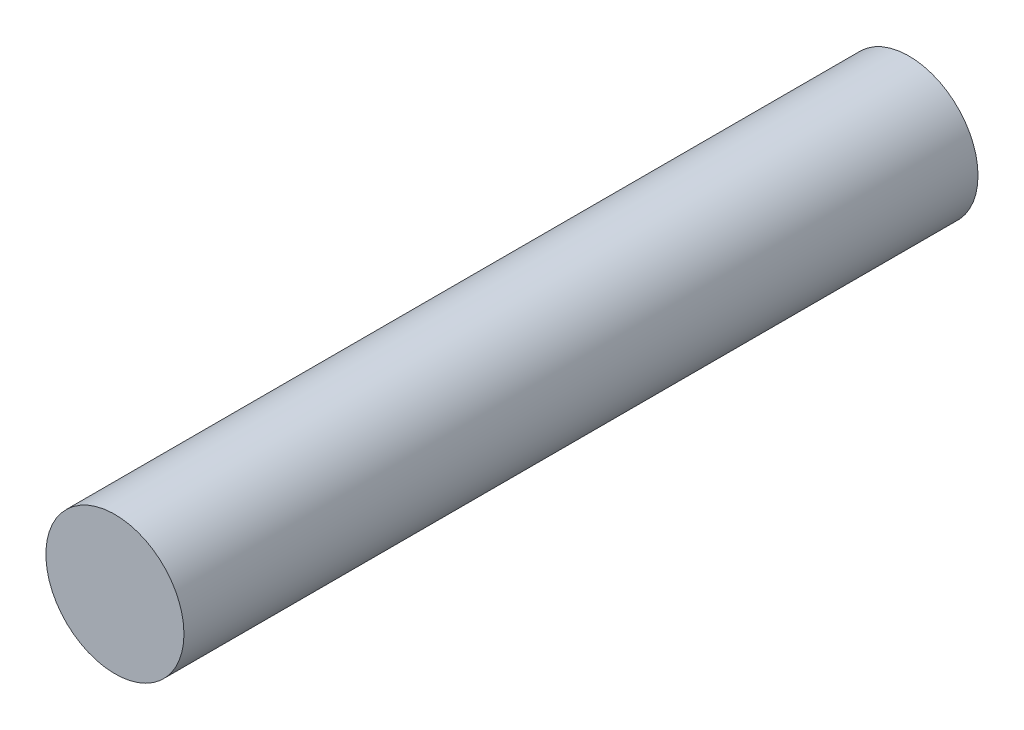
ISO-10303-21;
HEADER;
FILE_DESCRIPTION(('STEP AP214'),'2;1');
FILE_NAME('part.step','',(''),(''),'','','');
FILE_SCHEMA(('AUTOMOTIVE_DESIGN { 1 0 10303 214 1 1 1 1 }'));
ENDSEC;
DATA;
#1=APPLICATION_CONTEXT('core data for automotive mechanical design processes');
#2=APPLICATION_PROTOCOL_DEFINITION('international standard','automotive_design',2000,#1);
#3=PRODUCT_CONTEXT('',#1,'mechanical');
#4=PRODUCT('Part','Part','',(#3));
#5=PRODUCT_RELATED_PRODUCT_CATEGORY('part','',(#4));
#6=PRODUCT_DEFINITION_FORMATION('','',#4);
#7=PRODUCT_DEFINITION_CONTEXT('part definition',#1,'design');
#8=PRODUCT_DEFINITION('design','',#6,#7);
#9=PRODUCT_DEFINITION_SHAPE('','',#8);
#10=(LENGTH_UNIT() NAMED_UNIT(*) SI_UNIT(.MILLI.,.METRE.));
#11=(NAMED_UNIT(*) PLANE_ANGLE_UNIT() SI_UNIT($,.RADIAN.));
#12=(NAMED_UNIT(*) SI_UNIT($,.STERADIAN.) SOLID_ANGLE_UNIT());
#13=UNCERTAINTY_MEASURE_WITH_UNIT(LENGTH_MEASURE(1.E-05),#10,'distance_accuracy_value','');
#14=(GEOMETRIC_REPRESENTATION_CONTEXT(3) GLOBAL_UNCERTAINTY_ASSIGNED_CONTEXT((#13)) GLOBAL_UNIT_ASSIGNED_CONTEXT((#10,
#11,#12)) REPRESENTATION_CONTEXT('',''));
#15=CARTESIAN_POINT('',(0.,0.,0.));
#16=DIRECTION('',(0.,0.,1.));
#17=DIRECTION('',(1.,0.,0.));
#18=AXIS2_PLACEMENT_3D('',#15,#16,#17);
#19=CARTESIAN_POINT('',(0.,0.,115.));
#20=DIRECTION('',(0.,0.,-1.));
#21=DIRECTION('',(-1.,0.,0.));
#22=AXIS2_PLACEMENT_3D('',#19,#20,#21);
#23=CYLINDRICAL_SURFACE('',#22,10.);
#24=CARTESIAN_POINT('',(0.,0.,115.));
#25=DIRECTION('',(0.,0.,1.));
#26=DIRECTION('',(1.,0.,0.));
#27=AXIS2_PLACEMENT_3D('',#24,#25,#26);
#28=CIRCLE('',#27,10.);
#29=CARTESIAN_POINT('',(10.,0.,115.));
#30=VERTEX_POINT('',#29);
#31=EDGE_CURVE('E10',#30,#30,#28,.T.);
#32=ORIENTED_EDGE('',*,*,#31,.F.);
#33=EDGE_LOOP('',(#32));
#34=FACE_BOUND('',#33,.T.);
#35=CARTESIAN_POINT('',(0.,0.,0.));
#36=DIRECTION('',(0.,0.,1.));
#37=DIRECTION('',(1.,0.,0.));
#38=AXIS2_PLACEMENT_3D('',#35,#36,#37);
#39=CIRCLE('',#38,10.);
#40=CARTESIAN_POINT('',(10.,0.,0.));
#41=VERTEX_POINT('',#40);
#42=EDGE_CURVE('E42',#41,#41,#39,.T.);
#43=ORIENTED_EDGE('',*,*,#42,.T.);
#44=EDGE_LOOP('',(#43));
#45=FACE_BOUND('',#44,.T.);
#46=ADVANCED_FACE('F39',(#34,#45),#23,.T.);
#47=CARTESIAN_POINT('',(0.,0.,115.));
#48=DIRECTION('',(0.,0.,1.));
#49=DIRECTION('',(1.,0.,0.));
#50=AXIS2_PLACEMENT_3D('',#47,#48,#49);
#51=PLANE('',#50);
#52=ORIENTED_EDGE('',*,*,#31,.T.);
#53=EDGE_LOOP('',(#52));
#54=FACE_BOUND('',#53,.T.);
#55=ADVANCED_FACE('F72',(#54),#51,.T.);
#56=CARTESIAN_POINT('',(0.,0.,0.));
#57=DIRECTION('',(0.,0.,1.));
#58=DIRECTION('',(1.,0.,0.));
#59=AXIS2_PLACEMENT_3D('',#56,#57,#58);
#60=PLANE('',#59);
#61=CARTESIAN_POINT('',(0.,0.,0.));
#62=DIRECTION('',(0.,0.,-1.));
#63=DIRECTION('',(-1.,0.,0.));
#64=AXIS2_PLACEMENT_3D('',#61,#62,#63);
#65=CIRCLE('',#64,5.08);
#66=CARTESIAN_POINT('',(-5.08,0.,0.));
#67=VERTEX_POINT('',#66);
#68=EDGE_CURVE('E53',#67,#67,#65,.T.);
#69=ORIENTED_EDGE('',*,*,#68,.F.);
#70=EDGE_LOOP('',(#69));
#71=FACE_BOUND('',#70,.T.);
#72=ORIENTED_EDGE('',*,*,#42,.F.);
#73=EDGE_LOOP('',(#72));
#74=FACE_BOUND('',#73,.T.);
#75=ADVANCED_FACE('F66',(#71,#74),#60,.F.);
#76=CARTESIAN_POINT('',(0.,0.,2.54));
#77=DIRECTION('',(0.,0.,-1.));
#78=DIRECTION('',(-1.,0.,0.));
#79=AXIS2_PLACEMENT_3D('',#76,#77,#78);
#80=CYLINDRICAL_SURFACE('',#79,5.08);
#81=CARTESIAN_POINT('',(0.,0.,2.54));
#82=DIRECTION('',(0.,0.,-1.));
#83=DIRECTION('',(-1.,0.,0.));
#84=AXIS2_PLACEMENT_3D('',#81,#82,#83);
#85=CIRCLE('',#84,5.08);
#86=CARTESIAN_POINT('',(-5.08,0.,2.54));
#87=VERTEX_POINT('',#86);
#88=EDGE_CURVE('E51',#87,#87,#85,.T.);
#89=ORIENTED_EDGE('',*,*,#88,.F.);
#90=EDGE_LOOP('',(#89));
#91=FACE_BOUND('',#90,.T.);
#92=ORIENTED_EDGE('',*,*,#68,.T.);
#93=EDGE_LOOP('',(#92));
#94=FACE_BOUND('',#93,.T.);
#95=ADVANCED_FACE('F63',(#91,#94),#80,.F.);
#96=CARTESIAN_POINT('',(0.,0.,2.54));
#97=DIRECTION('',(0.,0.,-1.));
#98=DIRECTION('',(-1.,0.,0.));
#99=AXIS2_PLACEMENT_3D('',#96,#97,#98);
#100=PLANE('',#99);
#101=ORIENTED_EDGE('',*,*,#88,.T.);
#102=EDGE_LOOP('',(#101));
#103=FACE_BOUND('',#102,.T.);
#104=ADVANCED_FACE('F61',(#103),#100,.T.);
#105=CLOSED_SHELL('',(#46,#55,#75,#95,#104));
#106=MANIFOLD_SOLID_BREP('B2',#105);
#107=ADVANCED_BREP_SHAPE_REPRESENTATION('',(#18,#106),#14);
#108=SHAPE_DEFINITION_REPRESENTATION(#9,#107);
ENDSEC;
END-ISO-10303-21;
